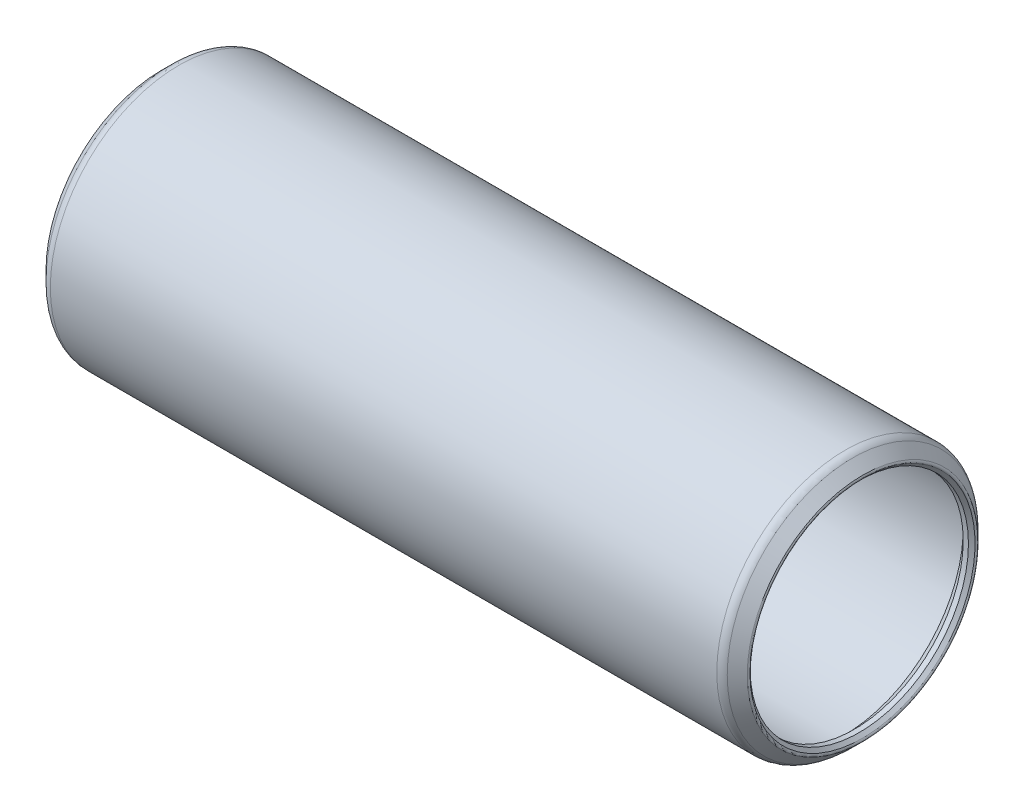
ISO-10303-21;
HEADER;
FILE_DESCRIPTION(('STEP AP214'),'2;1');
FILE_NAME('part.step','',(''),(''),'','','');
FILE_SCHEMA(('AUTOMOTIVE_DESIGN { 1 0 10303 214 1 1 1 1 }'));
ENDSEC;
DATA;
#1=APPLICATION_CONTEXT('core data for automotive mechanical design processes');
#2=APPLICATION_PROTOCOL_DEFINITION('international standard','automotive_design',2000,#1);
#3=PRODUCT_CONTEXT('',#1,'mechanical');
#4=PRODUCT('Part','Part','',(#3));
#5=PRODUCT_RELATED_PRODUCT_CATEGORY('part','',(#4));
#6=PRODUCT_DEFINITION_FORMATION('','',#4);
#7=PRODUCT_DEFINITION_CONTEXT('part definition',#1,'design');
#8=PRODUCT_DEFINITION('design','',#6,#7);
#9=PRODUCT_DEFINITION_SHAPE('','',#8);
#10=(LENGTH_UNIT() NAMED_UNIT(*) SI_UNIT(.MILLI.,.METRE.));
#11=(NAMED_UNIT(*) PLANE_ANGLE_UNIT() SI_UNIT($,.RADIAN.));
#12=(NAMED_UNIT(*) SI_UNIT($,.STERADIAN.) SOLID_ANGLE_UNIT());
#13=UNCERTAINTY_MEASURE_WITH_UNIT(LENGTH_MEASURE(1.E-05),#10,'distance_accuracy_value','');
#14=(GEOMETRIC_REPRESENTATION_CONTEXT(3) GLOBAL_UNCERTAINTY_ASSIGNED_CONTEXT((#13)) GLOBAL_UNIT_ASSIGNED_CONTEXT((#10,
#11,#12)) REPRESENTATION_CONTEXT('',''));
#15=CARTESIAN_POINT('',(0.,0.,0.));
#16=DIRECTION('',(0.,0.,1.));
#17=DIRECTION('',(1.,0.,0.));
#18=AXIS2_PLACEMENT_3D('',#15,#16,#17);
#19=CARTESIAN_POINT('',(-0.428157683632184,0.,0.));
#20=DIRECTION('',(-1.,0.,0.));
#21=DIRECTION('',(0.,0.,1.));
#22=AXIS2_PLACEMENT_3D('',#19,#20,#21);
#23=TOROIDAL_SURFACE('',#22,6.92601280605345,0.126999999999896);
#24=CARTESIAN_POINT('',(-0.517960244842769,0.,0.));
#25=DIRECTION('',(-1.,0.,0.));
#26=DIRECTION('',(0.,0.,1.));
#27=AXIS2_PLACEMENT_3D('',#24,#25,#26);
#28=CIRCLE('',#27,6.8362102448428);
#29=CARTESIAN_POINT('',(-0.517960244842769,0.,6.8362102448428));
#30=VERTEX_POINT('',#29);
#31=EDGE_CURVE('E10',#30,#30,#28,.T.);
#32=ORIENTED_EDGE('',*,*,#31,.F.);
#33=EDGE_LOOP('',(#32));
#34=FACE_BOUND('',#33,.T.);
#35=CARTESIAN_POINT('',(-0.517960244842769,0.,0.));
#36=DIRECTION('',(-1.,0.,0.));
#37=DIRECTION('',(0.,0.,1.));
#38=AXIS2_PLACEMENT_3D('',#35,#36,#37);
#39=CIRCLE('',#38,7.0158153672641);
#40=CARTESIAN_POINT('',(-0.517960244842769,0.,7.0158153672641));
#41=VERTEX_POINT('',#40);
#42=EDGE_CURVE('E78',#41,#41,#39,.T.);
#43=ORIENTED_EDGE('',*,*,#42,.T.);
#44=EDGE_LOOP('',(#43));
#45=FACE_BOUND('',#44,.T.);
#46=ADVANCED_FACE('F32',(#34,#45),#23,.T.);
#47=CARTESIAN_POINT('',(-0.517960244842769,0.,0.));
#48=DIRECTION('',(-1.,0.,0.));
#49=DIRECTION('',(0.,0.,1.));
#50=AXIS2_PLACEMENT_3D('',#47,#48,#49);
#51=CONICAL_SURFACE('',#50,6.8362102448428,0.785398163397522);
#52=CARTESIAN_POINT('',(-0.317499999999998,0.,0.));
#53=DIRECTION('',(-1.,0.,0.));
#54=DIRECTION('',(0.,0.,1.));
#55=AXIS2_PLACEMENT_3D('',#52,#53,#54);
#56=CIRCLE('',#55,6.63575);
#57=CARTESIAN_POINT('',(-0.317499999999998,0.,6.63575));
#58=VERTEX_POINT('',#57);
#59=EDGE_CURVE('E38',#58,#58,#56,.T.);
#60=ORIENTED_EDGE('',*,*,#59,.F.);
#61=EDGE_LOOP('',(#60));
#62=FACE_BOUND('',#61,.T.);
#63=ORIENTED_EDGE('',*,*,#31,.T.);
#64=EDGE_LOOP('',(#63));
#65=FACE_BOUND('',#64,.T.);
#66=ADVANCED_FACE('F151',(#62,#65),#51,.F.);
#67=CARTESIAN_POINT('',(41.6052,0.,0.));
#68=DIRECTION('',(-1.,0.,0.));
#69=DIRECTION('',(0.,0.,1.));
#70=AXIS2_PLACEMENT_3D('',#67,#68,#69);
#71=CYLINDRICAL_SURFACE('',#70,6.63575);
#72=CARTESIAN_POINT('',(0.,0.,0.));
#73=DIRECTION('',(-1.,0.,0.));
#74=DIRECTION('',(0.,0.,1.));
#75=AXIS2_PLACEMENT_3D('',#72,#73,#74);
#76=CIRCLE('',#75,6.63575);
#77=CARTESIAN_POINT('',(0.,0.,6.63575));
#78=VERTEX_POINT('',#77);
#79=EDGE_CURVE('E42',#78,#78,#76,.T.);
#80=ORIENTED_EDGE('',*,*,#79,.F.);
#81=EDGE_LOOP('',(#80));
#82=FACE_BOUND('',#81,.T.);
#83=ORIENTED_EDGE('',*,*,#59,.T.);
#84=EDGE_LOOP('',(#83));
#85=FACE_BOUND('',#84,.T.);
#86=ADVANCED_FACE('F146',(#82,#85),#71,.F.);
#87=CARTESIAN_POINT('',(0.,0.,0.));
#88=DIRECTION('',(1.,0.,0.));
#89=DIRECTION('',(0.,0.,-1.));
#90=AXIS2_PLACEMENT_3D('',#87,#88,#89);
#91=CONICAL_SURFACE('',#90,6.63575,0.78539816339745);
#92=CARTESIAN_POINT('',(0.634999999999997,0.,0.));
#93=DIRECTION('',(-1.,0.,0.));
#94=DIRECTION('',(0.,0.,1.));
#95=AXIS2_PLACEMENT_3D('',#92,#93,#94);
#96=CIRCLE('',#95,7.27075);
#97=CARTESIAN_POINT('',(0.634999999999997,0.,7.27075));
#98=VERTEX_POINT('',#97);
#99=EDGE_CURVE('E46',#98,#98,#96,.T.);
#100=ORIENTED_EDGE('',*,*,#99,.F.);
#101=EDGE_LOOP('',(#100));
#102=FACE_BOUND('',#101,.T.);
#103=ORIENTED_EDGE('',*,*,#79,.T.);
#104=EDGE_LOOP('',(#103));
#105=FACE_BOUND('',#104,.T.);
#106=ADVANCED_FACE('F140',(#102,#105),#91,.F.);
#107=CARTESIAN_POINT('',(41.6052,0.,0.));
#108=DIRECTION('',(-1.,0.,0.));
#109=DIRECTION('',(0.,0.,1.));
#110=AXIS2_PLACEMENT_3D('',#107,#108,#109);
#111=CYLINDRICAL_SURFACE('',#110,7.27075);
#112=CARTESIAN_POINT('',(40.9702,0.,0.));
#113=DIRECTION('',(-1.,0.,0.));
#114=DIRECTION('',(0.,0.,1.));
#115=AXIS2_PLACEMENT_3D('',#112,#113,#114);
#116=CIRCLE('',#115,7.27075);
#117=CARTESIAN_POINT('',(40.9702,0.,7.27075));
#118=VERTEX_POINT('',#117);
#119=EDGE_CURVE('E51',#118,#118,#116,.T.);
#120=ORIENTED_EDGE('',*,*,#119,.F.);
#121=EDGE_LOOP('',(#120));
#122=FACE_BOUND('',#121,.T.);
#123=ORIENTED_EDGE('',*,*,#99,.T.);
#124=EDGE_LOOP('',(#123));
#125=FACE_BOUND('',#124,.T.);
#126=ADVANCED_FACE('F134',(#122,#125),#111,.F.);
#127=CARTESIAN_POINT('',(40.9702,0.,0.));
#128=DIRECTION('',(-1.,0.,0.));
#129=DIRECTION('',(0.,0.,1.));
#130=AXIS2_PLACEMENT_3D('',#127,#128,#129);
#131=CONICAL_SURFACE('',#130,7.27075,0.785398163397445);
#132=CARTESIAN_POINT('',(41.6052,0.,0.));
#133=DIRECTION('',(-1.,0.,0.));
#134=DIRECTION('',(0.,0.,1.));
#135=AXIS2_PLACEMENT_3D('',#132,#133,#134);
#136=CIRCLE('',#135,6.63575);
#137=CARTESIAN_POINT('',(41.6052,0.,6.63575));
#138=VERTEX_POINT('',#137);
#139=EDGE_CURVE('E54',#138,#138,#136,.T.);
#140=ORIENTED_EDGE('',*,*,#139,.F.);
#141=EDGE_LOOP('',(#140));
#142=FACE_BOUND('',#141,.T.);
#143=ORIENTED_EDGE('',*,*,#119,.T.);
#144=EDGE_LOOP('',(#143));
#145=FACE_BOUND('',#144,.T.);
#146=ADVANCED_FACE('F128',(#142,#145),#131,.F.);
#147=CARTESIAN_POINT('',(41.6052,0.,0.));
#148=DIRECTION('',(-1.,0.,0.));
#149=DIRECTION('',(0.,0.,1.));
#150=AXIS2_PLACEMENT_3D('',#147,#148,#149);
#151=CYLINDRICAL_SURFACE('',#150,6.63575);
#152=CARTESIAN_POINT('',(41.9227,0.,0.));
#153=DIRECTION('',(-1.,0.,0.));
#154=DIRECTION('',(0.,0.,1.));
#155=AXIS2_PLACEMENT_3D('',#152,#153,#154);
#156=CIRCLE('',#155,6.63575);
#157=CARTESIAN_POINT('',(41.9227,0.,6.63575));
#158=VERTEX_POINT('',#157);
#159=EDGE_CURVE('E57',#158,#158,#156,.T.);
#160=ORIENTED_EDGE('',*,*,#159,.F.);
#161=EDGE_LOOP('',(#160));
#162=FACE_BOUND('',#161,.T.);
#163=ORIENTED_EDGE('',*,*,#139,.T.);
#164=EDGE_LOOP('',(#163));
#165=FACE_BOUND('',#164,.T.);
#166=ADVANCED_FACE('F122',(#162,#165),#151,.F.);
#167=CARTESIAN_POINT('',(41.9227,0.,0.));
#168=DIRECTION('',(1.,0.,0.));
#169=DIRECTION('',(0.,0.,-1.));
#170=AXIS2_PLACEMENT_3D('',#167,#168,#169);
#171=CONICAL_SURFACE('',#170,6.63575,0.785398163397994);
#172=CARTESIAN_POINT('',(42.123160244842,0.,0.));
#173=DIRECTION('',(-1.,0.,0.));
#174=DIRECTION('',(0.,0.,1.));
#175=AXIS2_PLACEMENT_3D('',#172,#173,#174);
#176=CIRCLE('',#175,6.83621024484219);
#177=CARTESIAN_POINT('',(42.123160244842,0.,6.83621024484219));
#178=VERTEX_POINT('',#177);
#179=EDGE_CURVE('E60',#178,#178,#176,.T.);
#180=ORIENTED_EDGE('',*,*,#179,.F.);
#181=EDGE_LOOP('',(#180));
#182=FACE_BOUND('',#181,.T.);
#183=ORIENTED_EDGE('',*,*,#159,.T.);
#184=EDGE_LOOP('',(#183));
#185=FACE_BOUND('',#184,.T.);
#186=ADVANCED_FACE('F116',(#182,#185),#171,.F.);
#187=CARTESIAN_POINT('',(42.0333576836314,0.,0.));
#188=DIRECTION('',(-1.,0.,0.));
#189=DIRECTION('',(0.,0.,1.));
#190=AXIS2_PLACEMENT_3D('',#187,#188,#189);
#191=TOROIDAL_SURFACE('',#190,6.92601280605345,0.127000000000351);
#192=CARTESIAN_POINT('',(42.1231602448421,0.,0.));
#193=DIRECTION('',(-1.,0.,0.));
#194=DIRECTION('',(0.,0.,1.));
#195=AXIS2_PLACEMENT_3D('',#192,#193,#194);
#196=CIRCLE('',#195,7.01581536726438);
#197=CARTESIAN_POINT('',(42.1231602448421,0.,7.01581536726438));
#198=VERTEX_POINT('',#197);
#199=EDGE_CURVE('E63',#198,#198,#196,.T.);
#200=ORIENTED_EDGE('',*,*,#199,.F.);
#201=EDGE_LOOP('',(#200));
#202=FACE_BOUND('',#201,.T.);
#203=ORIENTED_EDGE('',*,*,#179,.T.);
#204=EDGE_LOOP('',(#203));
#205=FACE_BOUND('',#204,.T.);
#206=ADVANCED_FACE('F110',(#202,#205),#191,.T.);
#207=CARTESIAN_POINT('',(42.1231602448421,0.,0.));
#208=DIRECTION('',(-1.,0.,0.));
#209=DIRECTION('',(0.,0.,1.));
#210=AXIS2_PLACEMENT_3D('',#207,#208,#209);
#211=CONICAL_SURFACE('',#210,7.01581536726438,0.785398163397439);
#212=CARTESIAN_POINT('',(41.5144628060521,0.,0.));
#213=DIRECTION('',(-1.,0.,0.));
#214=DIRECTION('',(0.,0.,1.));
#215=AXIS2_PLACEMENT_3D('',#212,#213,#214);
#216=CIRCLE('',#215,7.62451280605431);
#217=CARTESIAN_POINT('',(41.5144628060521,0.,7.62451280605431));
#218=VERTEX_POINT('',#217);
#219=EDGE_CURVE('E66',#218,#218,#216,.T.);
#220=ORIENTED_EDGE('',*,*,#219,.F.);
#221=EDGE_LOOP('',(#220));
#222=FACE_BOUND('',#221,.T.);
#223=ORIENTED_EDGE('',*,*,#199,.T.);
#224=EDGE_LOOP('',(#223));
#225=FACE_BOUND('',#224,.T.);
#226=ADVANCED_FACE('F104',(#222,#225),#211,.T.);
#227=CARTESIAN_POINT('',(41.0654500000009,0.,0.));
#228=DIRECTION('',(-1.,0.,0.));
#229=DIRECTION('',(0.,0.,1.));
#230=AXIS2_PLACEMENT_3D('',#227,#228,#229);
#231=TOROIDAL_SURFACE('',#230,7.17550000000308,0.634999999996889);
#232=CARTESIAN_POINT('',(41.0654500000009,0.,0.));
#233=DIRECTION('',(-1.,0.,0.));
#234=DIRECTION('',(0.,0.,1.));
#235=AXIS2_PLACEMENT_3D('',#232,#233,#234);
#236=CIRCLE('',#235,7.81049999999996);
#237=CARTESIAN_POINT('',(41.0654500000009,0.,7.81049999999996));
#238=VERTEX_POINT('',#237);
#239=EDGE_CURVE('E69',#238,#238,#236,.T.);
#240=ORIENTED_EDGE('',*,*,#239,.F.);
#241=EDGE_LOOP('',(#240));
#242=FACE_BOUND('',#241,.T.);
#243=ORIENTED_EDGE('',*,*,#219,.T.);
#244=EDGE_LOOP('',(#243));
#245=FACE_BOUND('',#244,.T.);
#246=ADVANCED_FACE('F98',(#242,#245),#231,.T.);
#247=CARTESIAN_POINT('',(41.6052,0.,0.));
#248=DIRECTION('',(-1.,0.,0.));
#249=DIRECTION('',(0.,0.,1.));
#250=AXIS2_PLACEMENT_3D('',#247,#248,#249);
#251=CYLINDRICAL_SURFACE('',#250,7.81049999999998);
#252=CARTESIAN_POINT('',(0.539750000000012,0.,0.));
#253=DIRECTION('',(-1.,0.,0.));
#254=DIRECTION('',(0.,0.,1.));
#255=AXIS2_PLACEMENT_3D('',#252,#253,#254);
#256=CIRCLE('',#255,7.8105);
#257=CARTESIAN_POINT('',(0.539750000000012,0.,7.8105));
#258=VERTEX_POINT('',#257);
#259=EDGE_CURVE('E72',#258,#258,#256,.T.);
#260=ORIENTED_EDGE('',*,*,#259,.F.);
#261=EDGE_LOOP('',(#260));
#262=FACE_BOUND('',#261,.T.);
#263=ORIENTED_EDGE('',*,*,#239,.T.);
#264=EDGE_LOOP('',(#263));
#265=FACE_BOUND('',#264,.T.);
#266=ADVANCED_FACE('F92',(#262,#265),#251,.T.);
#267=CARTESIAN_POINT('',(0.539749999999892,0.,0.));
#268=DIRECTION('',(-1.,0.,0.));
#269=DIRECTION('',(0.,0.,1.));
#270=AXIS2_PLACEMENT_3D('',#267,#268,#269);
#271=TOROIDAL_SURFACE('',#270,7.17550000000016,0.634999999999845);
#272=CARTESIAN_POINT('',(0.0907371939465398,0.,0.));
#273=DIRECTION('',(-1.,0.,0.));
#274=DIRECTION('',(0.,0.,1.));
#275=AXIS2_PLACEMENT_3D('',#272,#273,#274);
#276=CIRCLE('',#275,7.6245128060535);
#277=CARTESIAN_POINT('',(0.0907371939465398,0.,7.6245128060535));
#278=VERTEX_POINT('',#277);
#279=EDGE_CURVE('E75',#278,#278,#276,.T.);
#280=ORIENTED_EDGE('',*,*,#279,.F.);
#281=EDGE_LOOP('',(#280));
#282=FACE_BOUND('',#281,.T.);
#283=ORIENTED_EDGE('',*,*,#259,.T.);
#284=EDGE_LOOP('',(#283));
#285=FACE_BOUND('',#284,.T.);
#286=ADVANCED_FACE('F86',(#282,#285),#271,.T.);
#287=CARTESIAN_POINT('',(0.0907371939465398,0.,0.));
#288=DIRECTION('',(1.,0.,0.));
#289=DIRECTION('',(0.,0.,-1.));
#290=AXIS2_PLACEMENT_3D('',#287,#288,#289);
#291=CONICAL_SURFACE('',#290,7.6245128060535,0.785398163397523);
#292=ORIENTED_EDGE('',*,*,#42,.F.);
#293=EDGE_LOOP('',(#292));
#294=FACE_BOUND('',#293,.T.);
#295=ORIENTED_EDGE('',*,*,#279,.T.);
#296=EDGE_LOOP('',(#295));
#297=FACE_BOUND('',#296,.T.);
#298=ADVANCED_FACE('F83',(#294,#297),#291,.T.);
#299=CLOSED_SHELL('',(#46,#66,#86,#106,#126,#146,#166,#186,#206,#226,#246,#266,#286,#298));
#300=MANIFOLD_SOLID_BREP('B2',#299);
#301=ADVANCED_BREP_SHAPE_REPRESENTATION('',(#18,#300),#14);
#302=SHAPE_DEFINITION_REPRESENTATION(#9,#301);
ENDSEC;
END-ISO-10303-21;
